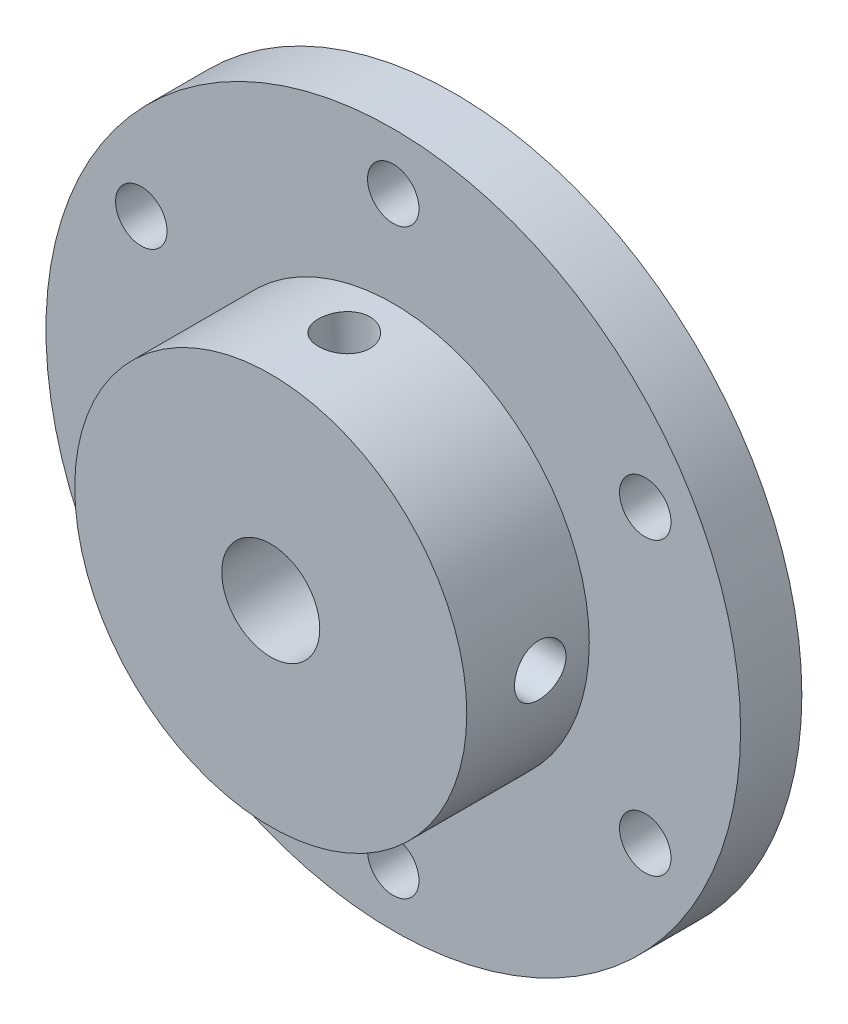
ISO-10303-21;
HEADER;
FILE_DESCRIPTION(('STEP AP214'),'2;1');
FILE_NAME('part.step','',(''),(''),'','','');
FILE_SCHEMA(('AUTOMOTIVE_DESIGN { 1 0 10303 214 1 1 1 1 }'));
ENDSEC;
DATA;
#1=APPLICATION_CONTEXT('core data for automotive mechanical design processes');
#2=APPLICATION_PROTOCOL_DEFINITION('international standard','automotive_design',2000,#1);
#3=PRODUCT_CONTEXT('',#1,'mechanical');
#4=PRODUCT('Part','Part','',(#3));
#5=PRODUCT_RELATED_PRODUCT_CATEGORY('part','',(#4));
#6=PRODUCT_DEFINITION_FORMATION('','',#4);
#7=PRODUCT_DEFINITION_CONTEXT('part definition',#1,'design');
#8=PRODUCT_DEFINITION('design','',#6,#7);
#9=PRODUCT_DEFINITION_SHAPE('','',#8);
#10=(LENGTH_UNIT() NAMED_UNIT(*) SI_UNIT(.MILLI.,.METRE.));
#11=(NAMED_UNIT(*) PLANE_ANGLE_UNIT() SI_UNIT($,.RADIAN.));
#12=(NAMED_UNIT(*) SI_UNIT($,.STERADIAN.) SOLID_ANGLE_UNIT());
#13=UNCERTAINTY_MEASURE_WITH_UNIT(LENGTH_MEASURE(1.E-05),#10,'distance_accuracy_value','');
#14=(GEOMETRIC_REPRESENTATION_CONTEXT(3) GLOBAL_UNCERTAINTY_ASSIGNED_CONTEXT((#13)) GLOBAL_UNIT_ASSIGNED_CONTEXT((#10,
#11,#12)) REPRESENTATION_CONTEXT('',''));
#15=CARTESIAN_POINT('',(0.,0.,0.));
#16=DIRECTION('',(0.,0.,1.));
#17=DIRECTION('',(1.,0.,0.));
#18=AXIS2_PLACEMENT_3D('',#15,#16,#17);
#19=CARTESIAN_POINT('',(0.,0.,5.));
#20=DIRECTION('',(0.,0.,-1.));
#21=DIRECTION('',(-1.,0.,0.));
#22=AXIS2_PLACEMENT_3D('',#19,#20,#21);
#23=CYLINDRICAL_SURFACE('',#22,28.35);
#24=CARTESIAN_POINT('',(0.,0.,5.));
#25=DIRECTION('',(0.,0.,1.));
#26=DIRECTION('',(1.,0.,0.));
#27=AXIS2_PLACEMENT_3D('',#24,#25,#26);
#28=CIRCLE('',#27,28.35);
#29=CARTESIAN_POINT('',(28.35,0.,5.));
#30=VERTEX_POINT('',#29);
#31=EDGE_CURVE('E10',#30,#30,#28,.T.);
#32=ORIENTED_EDGE('',*,*,#31,.F.);
#33=EDGE_LOOP('',(#32));
#34=FACE_BOUND('',#33,.T.);
#35=CARTESIAN_POINT('',(0.,0.,0.));
#36=DIRECTION('',(0.,0.,1.));
#37=DIRECTION('',(1.,0.,0.));
#38=AXIS2_PLACEMENT_3D('',#35,#36,#37);
#39=CIRCLE('',#38,28.35);
#40=CARTESIAN_POINT('',(28.35,0.,0.));
#41=VERTEX_POINT('',#40);
#42=EDGE_CURVE('E49',#41,#41,#39,.T.);
#43=ORIENTED_EDGE('',*,*,#42,.T.);
#44=EDGE_LOOP('',(#43));
#45=FACE_BOUND('',#44,.T.);
#46=ADVANCED_FACE('F46',(#34,#45),#23,.T.);
#47=CARTESIAN_POINT('',(0.,0.,5.));
#48=DIRECTION('',(0.,0.,1.));
#49=DIRECTION('',(1.,0.,0.));
#50=AXIS2_PLACEMENT_3D('',#47,#48,#49);
#51=PLANE('',#50);
#52=CARTESIAN_POINT('',(-20.5681033398803,11.8750000000002,5.));
#53=DIRECTION('',(0.,0.,1.));
#54=DIRECTION('',(1.,0.,0.));
#55=AXIS2_PLACEMENT_3D('',#52,#53,#54);
#56=CIRCLE('',#55,2.09999999999999);
#57=CARTESIAN_POINT('',(-18.4681033398803,11.8750000000002,5.));
#58=VERTEX_POINT('',#57);
#59=EDGE_CURVE('E119',#58,#58,#56,.T.);
#60=ORIENTED_EDGE('',*,*,#59,.F.);
#61=EDGE_LOOP('',(#60));
#62=FACE_BOUND('',#61,.T.);
#63=CARTESIAN_POINT('',(-20.5681033398805,-11.8749999999998,5.));
#64=DIRECTION('',(0.,0.,1.));
#65=DIRECTION('',(1.,0.,0.));
#66=AXIS2_PLACEMENT_3D('',#63,#64,#65);
#67=CIRCLE('',#66,2.09999999999999);
#68=CARTESIAN_POINT('',(-18.4681033398805,-11.8749999999998,5.));
#69=VERTEX_POINT('',#68);
#70=EDGE_CURVE('E112',#69,#69,#67,.T.);
#71=ORIENTED_EDGE('',*,*,#70,.F.);
#72=EDGE_LOOP('',(#71));
#73=FACE_BOUND('',#72,.T.);
#74=CARTESIAN_POINT('',(0.,-23.75,5.));
#75=DIRECTION('',(0.,0.,1.));
#76=DIRECTION('',(1.,0.,0.));
#77=AXIS2_PLACEMENT_3D('',#74,#75,#76);
#78=CIRCLE('',#77,2.09999999999999);
#79=CARTESIAN_POINT('',(2.09999999999999,-23.75,5.));
#80=VERTEX_POINT('',#79);
#81=EDGE_CURVE('E104',#80,#80,#78,.T.);
#82=ORIENTED_EDGE('',*,*,#81,.F.);
#83=EDGE_LOOP('',(#82));
#84=FACE_BOUND('',#83,.T.);
#85=CARTESIAN_POINT('',(20.5681033398804,-11.8750000000001,5.));
#86=DIRECTION('',(0.,0.,1.));
#87=DIRECTION('',(1.,0.,0.));
#88=AXIS2_PLACEMENT_3D('',#85,#86,#87);
#89=CIRCLE('',#88,2.09999999999999);
#90=CARTESIAN_POINT('',(22.6681033398804,-11.8750000000001,5.));
#91=VERTEX_POINT('',#90);
#92=EDGE_CURVE('E96',#91,#91,#89,.T.);
#93=ORIENTED_EDGE('',*,*,#92,.F.);
#94=EDGE_LOOP('',(#93));
#95=FACE_BOUND('',#94,.T.);
#96=CARTESIAN_POINT('',(20.5681033398804,11.875,5.));
#97=DIRECTION('',(0.,0.,1.));
#98=DIRECTION('',(1.,0.,0.));
#99=AXIS2_PLACEMENT_3D('',#96,#97,#98);
#100=CIRCLE('',#99,2.09999999999999);
#101=CARTESIAN_POINT('',(22.6681033398804,11.875,5.));
#102=VERTEX_POINT('',#101);
#103=EDGE_CURVE('E88',#102,#102,#100,.T.);
#104=ORIENTED_EDGE('',*,*,#103,.F.);
#105=EDGE_LOOP('',(#104));
#106=FACE_BOUND('',#105,.T.);
#107=CARTESIAN_POINT('',(0.,23.75,5.));
#108=DIRECTION('',(0.,0.,1.));
#109=DIRECTION('',(1.,0.,0.));
#110=AXIS2_PLACEMENT_3D('',#107,#108,#109);
#111=CIRCLE('',#110,2.09999999999999);
#112=CARTESIAN_POINT('',(2.09999999999999,23.75,5.));
#113=VERTEX_POINT('',#112);
#114=EDGE_CURVE('E80',#113,#113,#111,.T.);
#115=ORIENTED_EDGE('',*,*,#114,.F.);
#116=EDGE_LOOP('',(#115));
#117=FACE_BOUND('',#116,.T.);
#118=CARTESIAN_POINT('',(0.,0.,5.));
#119=DIRECTION('',(0.,0.,1.));
#120=DIRECTION('',(1.,0.,0.));
#121=AXIS2_PLACEMENT_3D('',#118,#119,#120);
#122=CIRCLE('',#121,16.);
#123=CARTESIAN_POINT('',(16.,0.,5.));
#124=VERTEX_POINT('',#123);
#125=EDGE_CURVE('E62',#124,#124,#122,.T.);
#126=ORIENTED_EDGE('',*,*,#125,.F.);
#127=EDGE_LOOP('',(#126));
#128=FACE_BOUND('',#127,.T.);
#129=ORIENTED_EDGE('',*,*,#31,.T.);
#130=EDGE_LOOP('',(#129));
#131=FACE_BOUND('',#130,.T.);
#132=ADVANCED_FACE('F182',(#62,#73,#84,#95,#106,#117,#128,#131),#51,.T.);
#133=CARTESIAN_POINT('',(0.,0.,0.));
#134=DIRECTION('',(0.,0.,1.));
#135=DIRECTION('',(1.,0.,0.));
#136=AXIS2_PLACEMENT_3D('',#133,#134,#135);
#137=PLANE('',#136);
#138=CARTESIAN_POINT('',(-20.5681033398803,11.8750000000002,0.));
#139=DIRECTION('',(0.,0.,1.));
#140=DIRECTION('',(1.,0.,0.));
#141=AXIS2_PLACEMENT_3D('',#138,#139,#140);
#142=CIRCLE('',#141,2.1);
#143=CARTESIAN_POINT('',(-18.4681033398803,11.8750000000002,0.));
#144=VERTEX_POINT('',#143);
#145=EDGE_CURVE('E115',#144,#144,#142,.T.);
#146=ORIENTED_EDGE('',*,*,#145,.T.);
#147=EDGE_LOOP('',(#146));
#148=FACE_BOUND('',#147,.T.);
#149=CARTESIAN_POINT('',(-20.5681033398805,-11.8749999999998,0.));
#150=DIRECTION('',(0.,0.,1.));
#151=DIRECTION('',(1.,0.,0.));
#152=AXIS2_PLACEMENT_3D('',#149,#150,#151);
#153=CIRCLE('',#152,2.1);
#154=CARTESIAN_POINT('',(-18.4681033398805,-11.8749999999998,0.));
#155=VERTEX_POINT('',#154);
#156=EDGE_CURVE('E108',#155,#155,#153,.T.);
#157=ORIENTED_EDGE('',*,*,#156,.T.);
#158=EDGE_LOOP('',(#157));
#159=FACE_BOUND('',#158,.T.);
#160=CARTESIAN_POINT('',(0.,-23.75,0.));
#161=DIRECTION('',(0.,0.,1.));
#162=DIRECTION('',(1.,0.,0.));
#163=AXIS2_PLACEMENT_3D('',#160,#161,#162);
#164=CIRCLE('',#163,2.1);
#165=CARTESIAN_POINT('',(2.1,-23.75,0.));
#166=VERTEX_POINT('',#165);
#167=EDGE_CURVE('E100',#166,#166,#164,.T.);
#168=ORIENTED_EDGE('',*,*,#167,.T.);
#169=EDGE_LOOP('',(#168));
#170=FACE_BOUND('',#169,.T.);
#171=CARTESIAN_POINT('',(20.5681033398804,-11.8750000000001,0.));
#172=DIRECTION('',(0.,0.,1.));
#173=DIRECTION('',(1.,0.,0.));
#174=AXIS2_PLACEMENT_3D('',#171,#172,#173);
#175=CIRCLE('',#174,2.1);
#176=CARTESIAN_POINT('',(22.6681033398804,-11.8750000000001,0.));
#177=VERTEX_POINT('',#176);
#178=EDGE_CURVE('E92',#177,#177,#175,.T.);
#179=ORIENTED_EDGE('',*,*,#178,.T.);
#180=EDGE_LOOP('',(#179));
#181=FACE_BOUND('',#180,.T.);
#182=CARTESIAN_POINT('',(20.5681033398804,11.875,0.));
#183=DIRECTION('',(0.,0.,1.));
#184=DIRECTION('',(1.,0.,0.));
#185=AXIS2_PLACEMENT_3D('',#182,#183,#184);
#186=CIRCLE('',#185,2.1);
#187=CARTESIAN_POINT('',(22.6681033398804,11.875,0.));
#188=VERTEX_POINT('',#187);
#189=EDGE_CURVE('E84',#188,#188,#186,.T.);
#190=ORIENTED_EDGE('',*,*,#189,.T.);
#191=EDGE_LOOP('',(#190));
#192=FACE_BOUND('',#191,.T.);
#193=CARTESIAN_POINT('',(0.,23.75,0.));
#194=DIRECTION('',(0.,0.,1.));
#195=DIRECTION('',(1.,0.,0.));
#196=AXIS2_PLACEMENT_3D('',#193,#194,#195);
#197=CIRCLE('',#196,2.1);
#198=CARTESIAN_POINT('',(2.1,23.75,0.));
#199=VERTEX_POINT('',#198);
#200=EDGE_CURVE('E73',#199,#199,#197,.T.);
#201=ORIENTED_EDGE('',*,*,#200,.T.);
#202=EDGE_LOOP('',(#201));
#203=FACE_BOUND('',#202,.T.);
#204=CARTESIAN_POINT('',(0.,0.,0.));
#205=DIRECTION('',(0.,0.,1.));
#206=DIRECTION('',(1.,0.,0.));
#207=AXIS2_PLACEMENT_3D('',#204,#205,#206);
#208=CIRCLE('',#207,4.);
#209=CARTESIAN_POINT('',(4.,0.,0.));
#210=VERTEX_POINT('',#209);
#211=EDGE_CURVE('E66',#210,#210,#208,.T.);
#212=ORIENTED_EDGE('',*,*,#211,.T.);
#213=EDGE_LOOP('',(#212));
#214=FACE_BOUND('',#213,.T.);
#215=ORIENTED_EDGE('',*,*,#42,.F.);
#216=EDGE_LOOP('',(#215));
#217=FACE_BOUND('',#216,.T.);
#218=ADVANCED_FACE('F186',(#148,#159,#170,#181,#192,#203,#214,#217),#137,.F.);
#219=CARTESIAN_POINT('',(0.,0.,15.));
#220=DIRECTION('',(0.,0.,-1.));
#221=DIRECTION('',(-1.,0.,0.));
#222=AXIS2_PLACEMENT_3D('',#219,#220,#221);
#223=CYLINDRICAL_SURFACE('',#222,16.);
#224=CARTESIAN_POINT('',(0.,16.,6.9));
#225=CARTESIAN_POINT('',(0.117416484353101,15.9999982962631,6.90000495705236));
#226=CARTESIAN_POINT('',(0.234905122011886,15.9986938773925,6.90988080691643));
#227=CARTESIAN_POINT('',(0.46660966558349,15.9936157778764,6.94911967052718));
#228=CARTESIAN_POINT('',(0.580822081998047,15.9898395595276,6.97850271201433));
#229=CARTESIAN_POINT('',(0.802586512568985,15.9802430281394,7.05587240992261));
#230=CARTESIAN_POINT('',(0.910143079615392,15.9744241309754,7.10384618263218));
#231=CARTESIAN_POINT('',(1.1156593399402,15.9613884397463,7.21700655797674));
#232=CARTESIAN_POINT('',(1.21362060219516,15.9541718747973,7.28219034005323));
#233=CARTESIAN_POINT('',(1.39777717587374,15.9390970395828,7.4283413083698));
#234=CARTESIAN_POINT('',(1.48390610575507,15.9312355150333,7.50939181113075));
#235=CARTESIAN_POINT('',(1.64138117851605,15.9157828604001,7.68479647193949));
#236=CARTESIAN_POINT('',(1.71272654645484,15.908191744508,7.77915132695387));
#237=CARTESIAN_POINT('',(1.83885928171324,15.8941075163014,7.9789213126258));
#238=CARTESIAN_POINT('',(1.89358395666576,15.8876186009931,8.08437634803382));
#239=CARTESIAN_POINT('',(1.98452144739534,15.8765168113299,8.30307955175785));
#240=CARTESIAN_POINT('',(2.02073503589053,15.8719038586674,8.41632739455061));
#241=CARTESIAN_POINT('',(2.0734195616491,15.8651076274545,8.64671017399985));
#242=CARTESIAN_POINT('',(2.0900029894288,15.8629105101852,8.76381897060127));
#243=CARTESIAN_POINT('',(2.10330463008907,15.8611524584727,8.9991763708029));
#244=CARTESIAN_POINT('',(2.10002372107694,15.8615914075016,9.11742492378924));
#245=CARTESIAN_POINT('',(2.07378206445453,15.8650432287045,9.35091875534377));
#246=CARTESIAN_POINT('',(2.05094554741099,15.86803985239,9.46617827025772));
#247=CARTESIAN_POINT('',(1.98643489899057,15.8762440291591,9.69121497797564));
#248=CARTESIAN_POINT('',(1.94476035031288,15.8814516312202,9.80099204927247));
#249=CARTESIAN_POINT('',(1.84362411100889,15.8935093147413,10.0123317781193));
#250=CARTESIAN_POINT('',(1.78410875473803,15.9003643391794,10.1138684605443));
#251=CARTESIAN_POINT('',(1.64901867206016,15.9149407211294,10.3055604124572));
#252=CARTESIAN_POINT('',(1.57344313629226,15.9226621222936,10.395715107979));
#253=CARTESIAN_POINT('',(1.40769104741128,15.9381733835384,10.5628047526722));
#254=CARTESIAN_POINT('',(1.31740747591083,15.9459633163989,10.6396335731953));
#255=CARTESIAN_POINT('',(1.12516973659486,15.9606788849759,10.7770631591691));
#256=CARTESIAN_POINT('',(1.02321553695396,15.9676045183355,10.8376638803649));
#257=CARTESIAN_POINT('',(0.810446436820828,15.9798160936183,10.9409183626588));
#258=CARTESIAN_POINT('',(0.699628098002014,15.9851013953531,10.9835651189946));
#259=CARTESIAN_POINT('',(0.472318289200564,15.9934311173904,11.0496149743927));
#260=CARTESIAN_POINT('',(0.355827112547463,15.9964756534268,11.0730190673325));
#261=CARTESIAN_POINT('',(0.121395629387381,15.9999656992249,11.0997808566156));
#262=CARTESIAN_POINT('',(0.00347227541262585,16.0004301540478,11.103284681241));
#263=CARTESIAN_POINT('',(-0.231280014343775,15.9987589549612,11.0905326292899));
#264=CARTESIAN_POINT('',(-0.348108975814987,15.9966233622396,11.0742772177153));
#265=CARTESIAN_POINT('',(-0.576922284105939,15.990003800972,11.0225895536893));
#266=CARTESIAN_POINT('',(-0.688922719796446,15.9855284102365,10.9872273319612));
#267=CARTESIAN_POINT('',(-0.905403997412974,15.974730073111,10.8984029024912));
#268=CARTESIAN_POINT('',(-1.00988456025589,15.9684070581947,10.8449400234038));
#269=CARTESIAN_POINT('',(-1.2090105555854,15.9545706371482,10.721080854769));
#270=CARTESIAN_POINT('',(-1.30359699513709,15.947050698098,10.6505904659569));
#271=CARTESIAN_POINT('',(-1.47964872574463,15.9316811346644,10.4948098674338));
#272=CARTESIAN_POINT('',(-1.56111344006267,15.9238314958089,10.4095190075414));
#273=CARTESIAN_POINT('',(-1.70913080865221,15.9086283992346,10.2259132317372));
#274=CARTESIAN_POINT('',(-1.77558633636806,15.9012783770394,10.1275196890213));
#275=CARTESIAN_POINT('',(-1.89102695628024,15.8879642527691,9.9208813855286));
#276=CARTESIAN_POINT('',(-1.94001242853152,15.8820001205453,9.81263683912125));
#277=CARTESIAN_POINT('',(-2.01896672841902,15.8721568354206,9.58967701758747));
#278=CARTESIAN_POINT('',(-2.04898946191644,15.8682717771357,9.47498110347114));
#279=CARTESIAN_POINT('',(-2.08933920892608,15.8630098837321,9.24212126875103));
#280=CARTESIAN_POINT('',(-2.09966724065018,15.8616329189455,9.12395752775389));
#281=CARTESIAN_POINT('',(-2.10031443069061,15.8615471546198,8.88848292944531));
#282=CARTESIAN_POINT('',(-2.09078619999575,15.8628180045269,8.77117246991539));
#283=CARTESIAN_POINT('',(-2.05231540968838,15.8678408142836,8.53983620079543));
#284=CARTESIAN_POINT('',(-2.02337285486407,15.8715927735212,8.4258103903953));
#285=CARTESIAN_POINT('',(-1.94694420408523,15.8811485642185,8.20430550752034));
#286=CARTESIAN_POINT('',(-1.89946624400469,15.8869514953252,8.09682358658503));
#287=CARTESIAN_POINT('',(-1.78732950445978,15.8999567709492,7.89132723687448));
#288=CARTESIAN_POINT('',(-1.7226704229297,15.9071591400699,7.79331297459389));
#289=CARTESIAN_POINT('',(-1.57744326503153,15.9222180092564,7.60875508025564));
#290=CARTESIAN_POINT('',(-1.49676157774286,15.9300789344295,7.52230120152492));
#291=CARTESIAN_POINT('',(-1.32201773458277,15.9455305998353,7.36410229468749));
#292=CARTESIAN_POINT('',(-1.22795244033518,15.9531212761728,7.29236072619036));
#293=CARTESIAN_POINT('',(-1.02865642383035,15.9672126278133,7.16536363306548));
#294=CARTESIAN_POINT('',(-0.92338060789378,15.9737086069784,7.1101783818222));
#295=CARTESIAN_POINT('',(-0.705026961411324,15.9848315489309,7.01835047192648));
#296=CARTESIAN_POINT('',(-0.591957665878867,15.9894605194548,6.98168788366503));
#297=CARTESIAN_POINT('',(-0.398600577498265,15.9952257223333,6.93661582244385));
#298=CARTESIAN_POINT('',(-0.319526543474694,15.9970072452264,6.92290490974843));
#299=CARTESIAN_POINT('',(-0.160312880332424,15.9993949607654,6.90459534461191));
#300=CARTESIAN_POINT('',(-0.0801732602122652,16.0000011633302,6.89999661527041));
#301=CARTESIAN_POINT('',(0.,16.,6.9));
#302=B_SPLINE_CURVE_WITH_KNOTS('',3,(#224,#225,#226,#227,#228,#229,#230,#231,#232,#233,#234,
#235,#236,#237,#238,#239,#240,#241,#242,#243,#244,#245,#246,#247,#248,#249,#250,#251,#252,#253,
#254,#255,#256,#257,#258,#259,#260,#261,#262,#263,#264,#265,#266,#267,#268,#269,#270,#271,#272,
#273,#274,#275,#276,#277,#278,#279,#280,#281,#282,#283,#284,#285,#286,#287,#288,#289,#290,#291,
#292,#293,#294,#295,#296,#297,#298,#299,#300,#301),.UNSPECIFIED.,.T.,.F.,(4,2,2,2,2,2,2,2,2,2,2,
2,2,2,2,2,2,2,2,2,2,2,2,2,2,2,2,2,2,2,2,2,2,2,2,2,2,2,4),(0.,0.351956579597511,
0.704275067694986,1.05634982812868,1.40836692260357,1.76228460352201,2.11622083179281,
2.47147596652803,2.82671627044792,3.17991086217002,3.53308984096311,3.88404169036012,
4.23500131443719,4.58702741286474,4.93907125603529,5.29380151830566,5.64853274793558,
6.00340224843456,6.3582534188827,6.71049550361345,7.06272929905445,7.41368075090289,
7.76464522081313,8.11759548065945,8.47056124946068,8.82574953425381,9.18093009157841,
9.53509636913479,9.88924433587378,10.2406804386662,10.5921164547833,10.9433983857755,
11.2946864931543,11.6485606276522,12.0025178807117,12.3579569170413,12.7130126970204,
12.9533345286082,13.1936543320409),.UNSPECIFIED.);
#303=CARTESIAN_POINT('',(0.,16.,6.9));
#304=VERTEX_POINT('',#303);
#305=EDGE_CURVE('E324',#304,#304,#302,.T.);
#306=ORIENTED_EDGE('',*,*,#305,.T.);
#307=EDGE_LOOP('',(#306));
#308=FACE_BOUND('',#307,.T.);
#309=CARTESIAN_POINT('',(16.,0.,11.1));
#310=CARTESIAN_POINT('',(15.9999982962631,0.117416484353101,11.0999950429476));
#311=CARTESIAN_POINT('',(15.9986938773925,0.234905122011886,11.0901191930836));
#312=CARTESIAN_POINT('',(15.9936157778764,0.46660966558349,11.0508803294728));
#313=CARTESIAN_POINT('',(15.9898395595276,0.580822081998047,11.0214972879857));
#314=CARTESIAN_POINT('',(15.9802430281394,0.802586512568985,10.9441275900774));
#315=CARTESIAN_POINT('',(15.9744241309754,0.910143079615392,10.8961538173678));
#316=CARTESIAN_POINT('',(15.9613884397463,1.1156593399402,10.7829934420233));
#317=CARTESIAN_POINT('',(15.9541718747973,1.21362060219516,10.7178096599468));
#318=CARTESIAN_POINT('',(15.9390970395828,1.39777717587374,10.5716586916302));
#319=CARTESIAN_POINT('',(15.9312355150333,1.48390610575507,10.4906081888693));
#320=CARTESIAN_POINT('',(15.9157828604001,1.64138117851605,10.3152035280605));
#321=CARTESIAN_POINT('',(15.908191744508,1.71272654645484,10.2208486730461));
#322=CARTESIAN_POINT('',(15.8941075163014,1.83885928171324,10.0210786873742));
#323=CARTESIAN_POINT('',(15.8876186009931,1.89358395666576,9.91562365196618));
#324=CARTESIAN_POINT('',(15.8765168113299,1.98452144739534,9.69692044824215));
#325=CARTESIAN_POINT('',(15.8719038586674,2.02073503589053,9.58367260544939));
#326=CARTESIAN_POINT('',(15.8651076274545,2.0734195616491,9.35328982600015));
#327=CARTESIAN_POINT('',(15.8629105101852,2.0900029894288,9.23618102939873));
#328=CARTESIAN_POINT('',(15.8611524584727,2.10330463008907,9.0008236291971));
#329=CARTESIAN_POINT('',(15.8615914075016,2.10002372107694,8.88257507621077));
#330=CARTESIAN_POINT('',(15.8650432287045,2.07378206445453,8.64908124465623));
#331=CARTESIAN_POINT('',(15.86803985239,2.05094554741099,8.53382172974228));
#332=CARTESIAN_POINT('',(15.8762440291591,1.98643489899057,8.30878502202437));
#333=CARTESIAN_POINT('',(15.8814516312202,1.94476035031288,8.19900795072753));
#334=CARTESIAN_POINT('',(15.8935093147413,1.84362411100889,7.98766822188072));
#335=CARTESIAN_POINT('',(15.9003643391794,1.78410875473803,7.88613153945571));
#336=CARTESIAN_POINT('',(15.9149407211294,1.64901867206016,7.69443958754275));
#337=CARTESIAN_POINT('',(15.9226621222936,1.57344313629226,7.60428489202098));
#338=CARTESIAN_POINT('',(15.9381733835384,1.40769104741128,7.43719524732779));
#339=CARTESIAN_POINT('',(15.9459633163989,1.31740747591083,7.36036642680472));
#340=CARTESIAN_POINT('',(15.9606788849759,1.12516973659486,7.22293684083089));
#341=CARTESIAN_POINT('',(15.9676045183355,1.02321553695397,7.16233611963506));
#342=CARTESIAN_POINT('',(15.9798160936183,0.81044643682083,7.05908163734115));
#343=CARTESIAN_POINT('',(15.9851013953531,0.699628098002016,7.01643488100538));
#344=CARTESIAN_POINT('',(15.9934311173904,0.472318289200565,6.95038502560732));
#345=CARTESIAN_POINT('',(15.9964756534268,0.355827112547464,6.92698093266746));
#346=CARTESIAN_POINT('',(15.9999656992249,0.121395629387381,6.90021914338435));
#347=CARTESIAN_POINT('',(16.0004301540478,0.00347227541262604,6.89671531875902));
#348=CARTESIAN_POINT('',(15.9987589549612,-0.231280014343775,6.90946737071011));
#349=CARTESIAN_POINT('',(15.9966233622396,-0.348108975814986,6.92572278228472));
#350=CARTESIAN_POINT('',(15.990003800972,-0.576922284105938,6.97741044631073));
#351=CARTESIAN_POINT('',(15.9855284102365,-0.688922719796446,7.01277266803877));
#352=CARTESIAN_POINT('',(15.974730073111,-0.905403997412974,7.10159709750879));
#353=CARTESIAN_POINT('',(15.9684070581947,-1.00988456025589,7.15505997659622));
#354=CARTESIAN_POINT('',(15.9545706371482,-1.2090105555854,7.27891914523096));
#355=CARTESIAN_POINT('',(15.947050698098,-1.30359699513709,7.34940953404312));
#356=CARTESIAN_POINT('',(15.9316811346644,-1.47964872574463,7.50519013256623));
#357=CARTESIAN_POINT('',(15.9238314958089,-1.56111344006267,7.59048099245864));
#358=CARTESIAN_POINT('',(15.9086283992346,-1.70913080865221,7.77408676826283));
#359=CARTESIAN_POINT('',(15.9012783770394,-1.77558633636806,7.87248031097871));
#360=CARTESIAN_POINT('',(15.8879642527691,-1.89102695628024,8.0791186144714));
#361=CARTESIAN_POINT('',(15.8820001205454,-1.94001242853152,8.18736316087875));
#362=CARTESIAN_POINT('',(15.8721568354206,-2.01896672841902,8.41032298241254));
#363=CARTESIAN_POINT('',(15.8682717771357,-2.04898946191644,8.52501889652886));
#364=CARTESIAN_POINT('',(15.8630098837321,-2.08933920892608,8.75787873124897));
#365=CARTESIAN_POINT('',(15.8616329189455,-2.09966724065018,8.87604247224611));
#366=CARTESIAN_POINT('',(15.8615471546198,-2.10031443069061,9.11151707055469));
#367=CARTESIAN_POINT('',(15.8628180045269,-2.09078619999575,9.22882753008461));
#368=CARTESIAN_POINT('',(15.8678408142836,-2.05231540968838,9.46016379920457));
#369=CARTESIAN_POINT('',(15.8715927735212,-2.02337285486407,9.5741896096047));
#370=CARTESIAN_POINT('',(15.8811485642185,-1.94694420408523,9.79569449247966));
#371=CARTESIAN_POINT('',(15.8869514953252,-1.89946624400469,9.90317641341496));
#372=CARTESIAN_POINT('',(15.8999567709492,-1.78732950445978,10.1086727631255));
#373=CARTESIAN_POINT('',(15.9071591400699,-1.7226704229297,10.2066870254061));
#374=CARTESIAN_POINT('',(15.9222180092564,-1.57744326503153,10.3912449197444));
#375=CARTESIAN_POINT('',(15.9300789344295,-1.49676157774286,10.4776987984751));
#376=CARTESIAN_POINT('',(15.9455305998353,-1.32201773458277,10.6358977053125));
#377=CARTESIAN_POINT('',(15.9531212761728,-1.22795244033518,10.7076392738096));
#378=CARTESIAN_POINT('',(15.9672126278133,-1.02865642383035,10.8346363669345));
#379=CARTESIAN_POINT('',(15.9737086069784,-0.923380607893781,10.8898216181778));
#380=CARTESIAN_POINT('',(15.9848315489309,-0.705026961411324,10.9816495280735));
#381=CARTESIAN_POINT('',(15.9894605194548,-0.591957665878868,11.018312116335));
#382=CARTESIAN_POINT('',(15.9952257223333,-0.398600577498267,11.0633841775562));
#383=CARTESIAN_POINT('',(15.9970072452264,-0.319526543474696,11.0770950902516));
#384=CARTESIAN_POINT('',(15.9993949607654,-0.160312880332425,11.0954046553881));
#385=CARTESIAN_POINT('',(16.0000011633302,-0.0801732602122659,11.1000033847296));
#386=CARTESIAN_POINT('',(16.,0.,11.1));
#387=B_SPLINE_CURVE_WITH_KNOTS('',3,(#309,#310,#311,#312,#313,#314,#315,#316,#317,#318,#319,
#320,#321,#322,#323,#324,#325,#326,#327,#328,#329,#330,#331,#332,#333,#334,#335,#336,#337,#338,
#339,#340,#341,#342,#343,#344,#345,#346,#347,#348,#349,#350,#351,#352,#353,#354,#355,#356,#357,
#358,#359,#360,#361,#362,#363,#364,#365,#366,#367,#368,#369,#370,#371,#372,#373,#374,#375,#376,
#377,#378,#379,#380,#381,#382,#383,#384,#385,#386),.UNSPECIFIED.,.T.,.F.,(4,2,2,2,2,2,2,2,2,2,2,
2,2,2,2,2,2,2,2,2,2,2,2,2,2,2,2,2,2,2,2,2,2,2,2,2,2,2,4),(0.,0.351956579597511,
0.704275067694986,1.05634982812868,1.40836692260357,1.76228460352201,2.11622083179281,
2.47147596652803,2.82671627044793,3.17991086217002,3.53308984096311,3.88404169036011,
4.23500131443719,4.58702741286474,4.93907125603529,5.29380151830566,5.64853274793558,
6.00340224843456,6.3582534188827,6.71049550361345,7.06272929905445,7.41368075090289,
7.76464522081313,8.11759548065946,8.47056124946068,8.82574953425381,9.18093009157841,
9.53509636913479,9.88924433587378,10.2406804386662,10.5921164547833,10.9433983857755,
11.2946864931543,11.6485606276522,12.0025178807117,12.3579569170413,12.7130126970204,
12.9533345286082,13.1936543320409),.UNSPECIFIED.);
#388=CARTESIAN_POINT('',(16.,0.,11.1));
#389=VERTEX_POINT('',#388);
#390=EDGE_CURVE('E132',#389,#389,#387,.T.);
#391=ORIENTED_EDGE('',*,*,#390,.T.);
#392=EDGE_LOOP('',(#391));
#393=FACE_BOUND('',#392,.T.);
#394=CARTESIAN_POINT('',(0.,0.,15.));
#395=DIRECTION('',(0.,0.,1.));
#396=DIRECTION('',(1.,0.,0.));
#397=AXIS2_PLACEMENT_3D('',#394,#395,#396);
#398=CIRCLE('',#397,16.);
#399=CARTESIAN_POINT('',(16.,0.,15.));
#400=VERTEX_POINT('',#399);
#401=EDGE_CURVE('E60',#400,#400,#398,.T.);
#402=ORIENTED_EDGE('',*,*,#401,.F.);
#403=EDGE_LOOP('',(#402));
#404=FACE_BOUND('',#403,.T.);
#405=ORIENTED_EDGE('',*,*,#125,.T.);
#406=EDGE_LOOP('',(#405));
#407=FACE_BOUND('',#406,.T.);
#408=ADVANCED_FACE('F193',(#308,#393,#404,#407),#223,.T.);
#409=CARTESIAN_POINT('',(0.,0.,15.));
#410=DIRECTION('',(0.,0.,1.));
#411=DIRECTION('',(1.,0.,0.));
#412=AXIS2_PLACEMENT_3D('',#409,#410,#411);
#413=PLANE('',#412);
#414=CARTESIAN_POINT('',(0.,0.,15.));
#415=DIRECTION('',(0.,0.,1.));
#416=DIRECTION('',(1.,0.,0.));
#417=AXIS2_PLACEMENT_3D('',#414,#415,#416);
#418=CIRCLE('',#417,4.);
#419=CARTESIAN_POINT('',(4.,0.,15.));
#420=VERTEX_POINT('',#419);
#421=EDGE_CURVE('E70',#420,#420,#418,.T.);
#422=ORIENTED_EDGE('',*,*,#421,.F.);
#423=EDGE_LOOP('',(#422));
#424=FACE_BOUND('',#423,.T.);
#425=ORIENTED_EDGE('',*,*,#401,.T.);
#426=EDGE_LOOP('',(#425));
#427=FACE_BOUND('',#426,.T.);
#428=ADVANCED_FACE('F177',(#424,#427),#413,.T.);
#429=CARTESIAN_POINT('',(0.,0.,0.));
#430=DIRECTION('',(0.,0.,1.));
#431=DIRECTION('',(1.,0.,0.));
#432=AXIS2_PLACEMENT_3D('',#429,#430,#431);
#433=CYLINDRICAL_SURFACE('',#432,4.);
#434=CARTESIAN_POINT('',(0.,4.,6.9));
#435=CARTESIAN_POINT('',(-0.109725239522176,3.99999264287857,6.90000850817598));
#436=CARTESIAN_POINT('',(-0.219566121797986,3.99543735627817,6.90865077782147));
#437=CARTESIAN_POINT('',(-0.435956332853303,3.97766056559727,6.94282051483628));
#438=CARTESIAN_POINT('',(-0.54249996702617,3.96442485872988,6.96837565544408));
#439=CARTESIAN_POINT('',(-0.748847767256637,3.93066356262107,7.03507317958002));
#440=CARTESIAN_POINT('',(-0.84867708849202,3.91016722161181,7.07615306803517));
#441=CARTESIAN_POINT('',(-1.0398542926017,3.86372814833453,7.17238731973));
#442=CARTESIAN_POINT('',(-1.13120230734359,3.83778550076629,7.22754146409275));
#443=CARTESIAN_POINT('',(-1.30947182891695,3.78081963010103,7.35439519620999));
#444=CARTESIAN_POINT('',(-1.39572427915895,3.7495762633363,7.42693455056421));
#445=CARTESIAN_POINT('',(-1.55546505007128,3.68618069665244,7.58467431609372));
#446=CARTESIAN_POINT('',(-1.62894256542358,3.65402775386038,7.66988533331476));
#447=CARTESIAN_POINT('',(-1.76753210720386,3.58917602274785,7.85947583581847));
#448=CARTESIAN_POINT('',(-1.83134596949796,3.55667651133239,7.96488088862584));
#449=CARTESIAN_POINT('',(-1.940078009522,3.49855992208216,8.18677898740505));
#450=CARTESIAN_POINT('',(-1.98501055983617,3.47293761465966,8.30326351646583));
#451=CARTESIAN_POINT('',(-2.05162778973323,3.43398312295476,8.5367308980096));
#452=CARTESIAN_POINT('',(-2.07458133375183,3.41998733122417,8.65323490430199));
#453=CARTESIAN_POINT('',(-2.1004206577409,3.40418721984817,8.88920803865535));
#454=CARTESIAN_POINT('',(-2.10333025607272,3.40236843025801,9.00867347806353));
#455=CARTESIAN_POINT('',(-2.08992575686748,3.41060563138389,9.22976414099399));
#456=CARTESIAN_POINT('',(-2.07615752002026,3.4190893964975,9.33161764684634));
#457=CARTESIAN_POINT('',(-2.03424482005422,3.44418916575293,9.53128014863959));
#458=CARTESIAN_POINT('',(-2.00609491145432,3.460808250155,9.62908759740539));
#459=CARTESIAN_POINT('',(-1.93576201725035,3.50064017337879,9.82066055866448));
#460=CARTESIAN_POINT('',(-1.89327386515966,3.52399463994301,9.91428317361142));
#461=CARTESIAN_POINT('',(-1.79571666755297,3.57469177714186,10.0935387455401));
#462=CARTESIAN_POINT('',(-1.74064200304353,3.60203622704668,10.179168109977));
#463=CARTESIAN_POINT('',(-1.61039398180522,3.66230444404028,10.3527804224098));
#464=CARTESIAN_POINT('',(-1.53347842501707,3.69546972830905,10.4393772694657));
#465=CARTESIAN_POINT('',(-1.36616462781175,3.76053926987168,10.5990549205067));
#466=CARTESIAN_POINT('',(-1.27575868558247,3.79244279356364,10.6721279498543));
#467=CARTESIAN_POINT('',(-1.07766804032998,3.85356353260701,10.8065821206847));
#468=CARTESIAN_POINT('',(-0.969298919443499,3.88252998474475,10.8670784688117));
#469=CARTESIAN_POINT('',(-0.742023442184863,3.93228772595726,10.968462670715));
#470=CARTESIAN_POINT('',(-0.623126340783868,3.95308610970455,11.0093675481865));
#471=CARTESIAN_POINT('',(-0.38939697462669,3.9825873442618,11.0667726791061));
#472=CARTESIAN_POINT('',(-0.275130823094224,3.99219507728301,11.0851069092832));
#473=CARTESIAN_POINT('',(-0.0447608666750934,4.00140669767392,11.1026931490091));
#474=CARTESIAN_POINT('',(0.0713418920739008,4.00101608864393,11.1019556566101));
#475=CARTESIAN_POINT('',(0.291279078552976,3.99076728683619,11.0823727421171));
#476=CARTESIAN_POINT('',(0.395299675486035,3.98173859499713,11.0651137704503));
#477=CARTESIAN_POINT('',(0.59872818219623,3.95626547527309,11.0155612495609));
#478=CARTESIAN_POINT('',(0.69813560404272,3.93982026491349,10.9832661139467));
#479=CARTESIAN_POINT('',(0.892553327327725,3.90044221082327,10.9038557461813));
#480=CARTESIAN_POINT('',(0.987382033379108,3.87735176388228,10.8563769257327));
#481=CARTESIAN_POINT('',(1.16801156602731,3.82682103032807,10.7483808249652));
#482=CARTESIAN_POINT('',(1.25380875133066,3.79937900035166,10.687858315483));
#483=CARTESIAN_POINT('',(1.42355402164766,3.73930849945052,10.5481654461086));
#484=CARTESIAN_POINT('',(1.50635375236175,3.70643824529688,10.4677018611849));
#485=CARTESIAN_POINT('',(1.65784945462858,3.64120206418591,10.2941486211428));
#486=CARTESIAN_POINT('',(1.72653319455466,3.60883659688132,10.201048131041));
#487=CARTESIAN_POINT('',(1.85197407713203,3.54618291275876,9.99766440984089));
#488=CARTESIAN_POINT('',(1.90772058421701,3.51615003477916,9.88667176437289));
#489=CARTESIAN_POINT('',(1.99916377433976,3.46498558301669,9.65483877403567));
#490=CARTESIAN_POINT('',(2.03488847416355,3.44384158132139,9.53401246223887));
#491=CARTESIAN_POINT('',(2.0817922879402,3.41567335738197,9.29850950473885));
#492=CARTESIAN_POINT('',(2.09503212797939,3.40746939702879,9.18438896876743));
#493=CARTESIAN_POINT('',(2.10264402498695,3.40278132518373,8.95530691556187));
#494=CARTESIAN_POINT('',(2.09702755352026,3.40629008804561,8.8403459520825));
#495=CARTESIAN_POINT('',(2.06905731966412,3.42333280060867,8.62683038567777));
#496=CARTESIAN_POINT('',(2.04869586578454,3.4356715106149,8.52790566448715));
#497=CARTESIAN_POINT('',(1.99445953447468,3.4674360798436,8.33503918598775));
#498=CARTESIAN_POINT('',(1.96057985676337,3.48686445637591,8.24109921218762));
#499=CARTESIAN_POINT('',(1.87782708009151,3.53215539501753,8.05400339874303));
#500=CARTESIAN_POINT('',(1.82811697206111,3.55835615136984,7.96130230842267));
#501=CARTESIAN_POINT('',(1.71597189148522,3.61377283019222,7.78493769078178));
#502=CARTESIAN_POINT('',(1.65353007488422,3.64299037017672,7.70127906149174));
#503=CARTESIAN_POINT('',(1.50756499361578,3.7059946066124,7.53327635286589));
#504=CARTESIAN_POINT('',(1.42231898680452,3.73985298438168,7.45044649023367));
#505=CARTESIAN_POINT('',(1.2383912708079,3.80472261290781,7.29984260805439));
#506=CARTESIAN_POINT('',(1.13970134446325,3.83573210281286,7.23207786376617));
#507=CARTESIAN_POINT('',(0.928722586410791,3.89224463430732,7.11256635095882));
#508=CARTESIAN_POINT('',(0.816206474636303,3.91762876470986,7.06115698939364));
#509=CARTESIAN_POINT('',(0.641101799511678,3.94873745727715,6.99929208684427));
#510=CARTESIAN_POINT('',(0.581718321049472,3.95794212176884,6.98121864301116));
#511=CARTESIAN_POINT('',(0.461272845180563,3.97377707651405,6.95034560887323));
#512=CARTESIAN_POINT('',(0.400211824286287,3.98040883184999,6.93754301695129));
#513=CARTESIAN_POINT('',(0.282777177199968,3.99038534961525,6.91835748923453));
#514=CARTESIAN_POINT('',(0.226504746010373,3.99398117175069,6.91148289088822));
#515=CARTESIAN_POINT('',(0.113498532604898,3.99879042332403,6.90230190074297));
#516=CARTESIAN_POINT('',(0.0567647413745307,4.00000380609873,6.8999955984201));
#517=CARTESIAN_POINT('',(0.,4.,6.9));
#518=B_SPLINE_CURVE_WITH_KNOTS('',3,(#434,#435,#436,#437,#438,#439,#440,#441,#442,#443,#444,
#445,#446,#447,#448,#449,#450,#451,#452,#453,#454,#455,#456,#457,#458,#459,#460,#461,#462,#463,
#464,#465,#466,#467,#468,#469,#470,#471,#472,#473,#474,#475,#476,#477,#478,#479,#480,#481,#482,
#483,#484,#485,#486,#487,#488,#489,#490,#491,#492,#493,#494,#495,#496,#497,#498,#499,#500,#501,
#502,#503,#504,#505,#506,#507,#508,#509,#510,#511,#512,#513,#514,#515,#516,#517),.UNSPECIFIED.,
.T.,.F.,(4,2,2,2,2,2,2,2,2,2,2,2,2,2,2,2,2,2,2,2,2,2,2,2,2,2,2,2,2,2,2,2,2,2,2,2,2,2,2,2,2,4),
(0.,0.328955388056857,0.658450355809533,0.986632826787797,1.31481019432105,1.66422610127769,
2.01393612903032,2.3943054227538,2.77438464995628,3.13089429519635,3.48698022433372,
3.79492330354659,4.10298306894291,4.41806287071791,4.73328360921356,5.0931748825876,
5.4532724136417,5.83355153918036,6.21349962504738,6.55994297045684,6.90619561978193,
7.22222027001751,7.53827827001648,7.86255611827312,8.18696421086293,8.54557019619714,
8.90448561862086,9.28577946390601,9.66653841880977,10.0100186118085,10.3532898805348,
10.6572136356427,10.9612454093544,11.2851996834104,11.6093285635883,11.9784125341219,
12.347723115996,12.7242211787441,12.9122308814787,13.1001333688401,13.270310275105,
13.4404905144749),.UNSPECIFIED.);
#519=CARTESIAN_POINT('',(0.,4.,6.9));
#520=VERTEX_POINT('',#519);
#521=EDGE_CURVE('E328',#520,#520,#518,.T.);
#522=ORIENTED_EDGE('',*,*,#521,.T.);
#523=EDGE_LOOP('',(#522));
#524=FACE_BOUND('',#523,.T.);
#525=CARTESIAN_POINT('',(4.,0.,6.9));
#526=CARTESIAN_POINT('',(3.99999264287857,0.109725239522176,6.90000850817598));
#527=CARTESIAN_POINT('',(3.99543735627817,0.219566121797986,6.90865077782147));
#528=CARTESIAN_POINT('',(3.97766056559727,0.435956332853303,6.94282051483628));
#529=CARTESIAN_POINT('',(3.96442485872988,0.54249996702617,6.96837565544408));
#530=CARTESIAN_POINT('',(3.93066356262107,0.748847767256637,7.03507317958002));
#531=CARTESIAN_POINT('',(3.91016722161181,0.84867708849202,7.07615306803517));
#532=CARTESIAN_POINT('',(3.86372814833453,1.0398542926017,7.17238731973));
#533=CARTESIAN_POINT('',(3.83778550076629,1.13120230734359,7.22754146409275));
#534=CARTESIAN_POINT('',(3.78081963010103,1.30947182891695,7.35439519620999));
#535=CARTESIAN_POINT('',(3.7495762633363,1.39572427915895,7.42693455056421));
#536=CARTESIAN_POINT('',(3.68618069665244,1.55546505007128,7.58467431609372));
#537=CARTESIAN_POINT('',(3.65402775386038,1.62894256542358,7.66988533331476));
#538=CARTESIAN_POINT('',(3.58917602274785,1.76753210720386,7.85947583581847));
#539=CARTESIAN_POINT('',(3.55667651133239,1.83134596949796,7.96488088862584));
#540=CARTESIAN_POINT('',(3.49855992208216,1.940078009522,8.18677898740505));
#541=CARTESIAN_POINT('',(3.47293761465966,1.98501055983617,8.30326351646583));
#542=CARTESIAN_POINT('',(3.43398312295476,2.05162778973323,8.5367308980096));
#543=CARTESIAN_POINT('',(3.41998733122417,2.07458133375183,8.65323490430199));
#544=CARTESIAN_POINT('',(3.40418721984817,2.1004206577409,8.88920803865535));
#545=CARTESIAN_POINT('',(3.40236843025801,2.10333025607272,9.00867347806353));
#546=CARTESIAN_POINT('',(3.41060563138389,2.08992575686748,9.22976414099399));
#547=CARTESIAN_POINT('',(3.4190893964975,2.07615752002026,9.33161764684634));
#548=CARTESIAN_POINT('',(3.44418916575293,2.03424482005422,9.53128014863959));
#549=CARTESIAN_POINT('',(3.460808250155,2.00609491145432,9.62908759740539));
#550=CARTESIAN_POINT('',(3.50064017337879,1.93576201725035,9.82066055866448));
#551=CARTESIAN_POINT('',(3.52399463994301,1.89327386515966,9.91428317361142));
#552=CARTESIAN_POINT('',(3.57469177714186,1.79571666755297,10.0935387455401));
#553=CARTESIAN_POINT('',(3.60203622704668,1.74064200304353,10.179168109977));
#554=CARTESIAN_POINT('',(3.66230444404028,1.61039398180522,10.3527804224098));
#555=CARTESIAN_POINT('',(3.69546972830905,1.53347842501707,10.4393772694657));
#556=CARTESIAN_POINT('',(3.76053926987168,1.36616462781175,10.5990549205067));
#557=CARTESIAN_POINT('',(3.79244279356364,1.27575868558247,10.6721279498543));
#558=CARTESIAN_POINT('',(3.85356353260701,1.07766804032998,10.8065821206847));
#559=CARTESIAN_POINT('',(3.88252998474475,0.969298919443499,10.8670784688117));
#560=CARTESIAN_POINT('',(3.93228772595726,0.742023442184863,10.968462670715));
#561=CARTESIAN_POINT('',(3.95308610970455,0.623126340783868,11.0093675481865));
#562=CARTESIAN_POINT('',(3.9825873442618,0.38939697462669,11.0667726791061));
#563=CARTESIAN_POINT('',(3.99219507728301,0.275130823094224,11.0851069092832));
#564=CARTESIAN_POINT('',(4.00140669767392,0.0447608666750934,11.1026931490091));
#565=CARTESIAN_POINT('',(4.00101608864393,-0.0713418920739008,11.1019556566101));
#566=CARTESIAN_POINT('',(3.99076728683619,-0.291279078552976,11.0823727421171));
#567=CARTESIAN_POINT('',(3.98173859499713,-0.395299675486035,11.0651137704503));
#568=CARTESIAN_POINT('',(3.95626547527309,-0.59872818219623,11.0155612495609));
#569=CARTESIAN_POINT('',(3.93982026491349,-0.69813560404272,10.9832661139467));
#570=CARTESIAN_POINT('',(3.90044221082327,-0.892553327327725,10.9038557461813));
#571=CARTESIAN_POINT('',(3.87735176388228,-0.987382033379108,10.8563769257327));
#572=CARTESIAN_POINT('',(3.82682103032807,-1.16801156602731,10.7483808249652));
#573=CARTESIAN_POINT('',(3.79937900035166,-1.25380875133066,10.687858315483));
#574=CARTESIAN_POINT('',(3.73930849945052,-1.42355402164766,10.5481654461086));
#575=CARTESIAN_POINT('',(3.70643824529688,-1.50635375236175,10.4677018611849));
#576=CARTESIAN_POINT('',(3.64120206418591,-1.65784945462858,10.2941486211428));
#577=CARTESIAN_POINT('',(3.60883659688132,-1.72653319455466,10.201048131041));
#578=CARTESIAN_POINT('',(3.54618291275876,-1.85197407713203,9.99766440984089));
#579=CARTESIAN_POINT('',(3.51615003477916,-1.90772058421701,9.88667176437289));
#580=CARTESIAN_POINT('',(3.46498558301669,-1.99916377433976,9.65483877403567));
#581=CARTESIAN_POINT('',(3.44384158132139,-2.03488847416355,9.53401246223887));
#582=CARTESIAN_POINT('',(3.41567335738197,-2.0817922879402,9.29850950473885));
#583=CARTESIAN_POINT('',(3.40746939702879,-2.09503212797939,9.18438896876743));
#584=CARTESIAN_POINT('',(3.40278132518373,-2.10264402498695,8.95530691556187));
#585=CARTESIAN_POINT('',(3.40629008804561,-2.09702755352026,8.8403459520825));
#586=CARTESIAN_POINT('',(3.42333280060867,-2.06905731966412,8.62683038567777));
#587=CARTESIAN_POINT('',(3.4356715106149,-2.04869586578454,8.52790566448715));
#588=CARTESIAN_POINT('',(3.4674360798436,-1.99445953447468,8.33503918598775));
#589=CARTESIAN_POINT('',(3.48686445637591,-1.96057985676337,8.24109921218762));
#590=CARTESIAN_POINT('',(3.53215539501753,-1.87782708009151,8.05400339874303));
#591=CARTESIAN_POINT('',(3.55835615136984,-1.82811697206111,7.96130230842267));
#592=CARTESIAN_POINT('',(3.61377283019222,-1.71597189148522,7.78493769078178));
#593=CARTESIAN_POINT('',(3.64299037017672,-1.65353007488422,7.70127906149174));
#594=CARTESIAN_POINT('',(3.7059946066124,-1.50756499361578,7.53327635286589));
#595=CARTESIAN_POINT('',(3.73985298438168,-1.42231898680452,7.45044649023367));
#596=CARTESIAN_POINT('',(3.80472261290781,-1.2383912708079,7.29984260805439));
#597=CARTESIAN_POINT('',(3.83573210281286,-1.13970134446325,7.23207786376617));
#598=CARTESIAN_POINT('',(3.89224463430732,-0.928722586410791,7.11256635095882));
#599=CARTESIAN_POINT('',(3.91762876470986,-0.816206474636303,7.06115698939364));
#600=CARTESIAN_POINT('',(3.94873745727715,-0.641101799511678,6.99929208684427));
#601=CARTESIAN_POINT('',(3.95794212176884,-0.581718321049472,6.98121864301116));
#602=CARTESIAN_POINT('',(3.97377707651405,-0.461272845180563,6.95034560887323));
#603=CARTESIAN_POINT('',(3.98040883184999,-0.400211824286287,6.93754301695129));
#604=CARTESIAN_POINT('',(3.99038534961525,-0.282777177199968,6.91835748923453));
#605=CARTESIAN_POINT('',(3.99398117175069,-0.226504746010373,6.91148289088822));
#606=CARTESIAN_POINT('',(3.99879042332403,-0.113498532604898,6.90230190074297));
#607=CARTESIAN_POINT('',(4.00000380609873,-0.0567647413745307,6.8999955984201));
#608=CARTESIAN_POINT('',(4.,0.,6.9));
#609=B_SPLINE_CURVE_WITH_KNOTS('',3,(#525,#526,#527,#528,#529,#530,#531,#532,#533,#534,#535,
#536,#537,#538,#539,#540,#541,#542,#543,#544,#545,#546,#547,#548,#549,#550,#551,#552,#553,#554,
#555,#556,#557,#558,#559,#560,#561,#562,#563,#564,#565,#566,#567,#568,#569,#570,#571,#572,#573,
#574,#575,#576,#577,#578,#579,#580,#581,#582,#583,#584,#585,#586,#587,#588,#589,#590,#591,#592,
#593,#594,#595,#596,#597,#598,#599,#600,#601,#602,#603,#604,#605,#606,#607,#608),.UNSPECIFIED.,
.T.,.F.,(4,2,2,2,2,2,2,2,2,2,2,2,2,2,2,2,2,2,2,2,2,2,2,2,2,2,2,2,2,2,2,2,2,2,2,2,2,2,2,2,2,4),
(0.,0.328955388056857,0.658450355809533,0.986632826787797,1.31481019432105,1.66422610127769,
2.01393612903032,2.3943054227538,2.77438464995628,3.13089429519635,3.48698022433372,
3.79492330354659,4.10298306894291,4.41806287071791,4.73328360921356,5.0931748825876,
5.4532724136417,5.83355153918036,6.21349962504738,6.55994297045684,6.90619561978193,
7.22222027001751,7.53827827001648,7.86255611827312,8.18696421086293,8.54557019619714,
8.90448561862086,9.28577946390601,9.66653841880977,10.0100186118085,10.3532898805348,
10.6572136356427,10.9612454093544,11.2851996834104,11.6093285635883,11.9784125341219,
12.347723115996,12.7242211787441,12.9122308814787,13.1001333688401,13.270310275105,
13.4404905144749),.UNSPECIFIED.);
#610=CARTESIAN_POINT('',(4.,0.,6.9));
#611=VERTEX_POINT('',#610);
#612=EDGE_CURVE('E123',#611,#611,#609,.T.);
#613=ORIENTED_EDGE('',*,*,#612,.T.);
#614=EDGE_LOOP('',(#613));
#615=FACE_BOUND('',#614,.T.);
#616=ORIENTED_EDGE('',*,*,#211,.F.);
#617=EDGE_LOOP('',(#616));
#618=FACE_BOUND('',#617,.T.);
#619=ORIENTED_EDGE('',*,*,#421,.T.);
#620=EDGE_LOOP('',(#619));
#621=FACE_BOUND('',#620,.T.);
#622=ADVANCED_FACE('F138',(#524,#615,#618,#621),#433,.F.);
#623=CARTESIAN_POINT('',(0.,23.75,5.));
#624=DIRECTION('',(0.,0.,1.));
#625=DIRECTION('',(1.,0.,0.));
#626=AXIS2_PLACEMENT_3D('',#623,#624,#625);
#627=CYLINDRICAL_SURFACE('',#626,2.09999999999999);
#628=ORIENTED_EDGE('',*,*,#200,.F.);
#629=EDGE_LOOP('',(#628));
#630=FACE_BOUND('',#629,.T.);
#631=ORIENTED_EDGE('',*,*,#114,.T.);
#632=EDGE_LOOP('',(#631));
#633=FACE_BOUND('',#632,.T.);
#634=ADVANCED_FACE('F171',(#630,#633),#627,.F.);
#635=CARTESIAN_POINT('',(20.5681033398804,11.875,5.));
#636=DIRECTION('',(0.,0.,1.));
#637=DIRECTION('',(1.,0.,0.));
#638=AXIS2_PLACEMENT_3D('',#635,#636,#637);
#639=CYLINDRICAL_SURFACE('',#638,2.09999999999999);
#640=ORIENTED_EDGE('',*,*,#189,.F.);
#641=EDGE_LOOP('',(#640));
#642=FACE_BOUND('',#641,.T.);
#643=ORIENTED_EDGE('',*,*,#103,.T.);
#644=EDGE_LOOP('',(#643));
#645=FACE_BOUND('',#644,.T.);
#646=ADVANCED_FACE('F168',(#642,#645),#639,.F.);
#647=CARTESIAN_POINT('',(20.5681033398804,-11.8750000000001,5.));
#648=DIRECTION('',(0.,0.,1.));
#649=DIRECTION('',(1.,0.,0.));
#650=AXIS2_PLACEMENT_3D('',#647,#648,#649);
#651=CYLINDRICAL_SURFACE('',#650,2.09999999999999);
#652=ORIENTED_EDGE('',*,*,#178,.F.);
#653=EDGE_LOOP('',(#652));
#654=FACE_BOUND('',#653,.T.);
#655=ORIENTED_EDGE('',*,*,#92,.T.);
#656=EDGE_LOOP('',(#655));
#657=FACE_BOUND('',#656,.T.);
#658=ADVANCED_FACE('F164',(#654,#657),#651,.F.);
#659=CARTESIAN_POINT('',(0.,-23.75,5.));
#660=DIRECTION('',(0.,0.,1.));
#661=DIRECTION('',(1.,0.,0.));
#662=AXIS2_PLACEMENT_3D('',#659,#660,#661);
#663=CYLINDRICAL_SURFACE('',#662,2.09999999999999);
#664=ORIENTED_EDGE('',*,*,#167,.F.);
#665=EDGE_LOOP('',(#664));
#666=FACE_BOUND('',#665,.T.);
#667=ORIENTED_EDGE('',*,*,#81,.T.);
#668=EDGE_LOOP('',(#667));
#669=FACE_BOUND('',#668,.T.);
#670=ADVANCED_FACE('F160',(#666,#669),#663,.F.);
#671=CARTESIAN_POINT('',(-20.5681033398805,-11.8749999999998,5.));
#672=DIRECTION('',(0.,0.,1.));
#673=DIRECTION('',(1.,0.,0.));
#674=AXIS2_PLACEMENT_3D('',#671,#672,#673);
#675=CYLINDRICAL_SURFACE('',#674,2.09999999999999);
#676=ORIENTED_EDGE('',*,*,#156,.F.);
#677=EDGE_LOOP('',(#676));
#678=FACE_BOUND('',#677,.T.);
#679=ORIENTED_EDGE('',*,*,#70,.T.);
#680=EDGE_LOOP('',(#679));
#681=FACE_BOUND('',#680,.T.);
#682=ADVANCED_FACE('F156',(#678,#681),#675,.F.);
#683=CARTESIAN_POINT('',(-20.5681033398803,11.8750000000002,5.));
#684=DIRECTION('',(0.,0.,1.));
#685=DIRECTION('',(1.,0.,0.));
#686=AXIS2_PLACEMENT_3D('',#683,#684,#685);
#687=CYLINDRICAL_SURFACE('',#686,2.09999999999999);
#688=ORIENTED_EDGE('',*,*,#145,.F.);
#689=EDGE_LOOP('',(#688));
#690=FACE_BOUND('',#689,.T.);
#691=ORIENTED_EDGE('',*,*,#59,.T.);
#692=EDGE_LOOP('',(#691));
#693=FACE_BOUND('',#692,.T.);
#694=ADVANCED_FACE('F147',(#690,#693),#687,.F.);
#695=CARTESIAN_POINT('',(0.,0.,9.));
#696=DIRECTION('',(-1.,0.,0.));
#697=DIRECTION('',(0.,0.,1.));
#698=AXIS2_PLACEMENT_3D('',#695,#696,#697);
#699=CYLINDRICAL_SURFACE('',#698,2.1);
#700=ORIENTED_EDGE('',*,*,#390,.F.);
#701=EDGE_LOOP('',(#700));
#702=FACE_BOUND('',#701,.T.);
#703=ORIENTED_EDGE('',*,*,#612,.F.);
#704=EDGE_LOOP('',(#703));
#705=FACE_BOUND('',#704,.T.);
#706=ADVANCED_FACE('F142',(#702,#705),#699,.F.);
#707=CARTESIAN_POINT('',(0.,0.,9.));
#708=DIRECTION('',(0.,-1.,0.));
#709=DIRECTION('',(0.,0.,-1.));
#710=AXIS2_PLACEMENT_3D('',#707,#708,#709);
#711=CYLINDRICAL_SURFACE('',#710,2.1);
#712=ORIENTED_EDGE('',*,*,#305,.F.);
#713=EDGE_LOOP('',(#712));
#714=FACE_BOUND('',#713,.T.);
#715=ORIENTED_EDGE('',*,*,#521,.F.);
#716=EDGE_LOOP('',(#715));
#717=FACE_BOUND('',#716,.T.);
#718=ADVANCED_FACE('F146',(#714,#717),#711,.F.);
#719=CLOSED_SHELL('',(#46,#132,#218,#408,#428,#622,#634,#646,#658,#670,#682,#694,#706,#718));
#720=MANIFOLD_SOLID_BREP('B2',#719);
#721=ADVANCED_BREP_SHAPE_REPRESENTATION('',(#18,#720),#14);
#722=SHAPE_DEFINITION_REPRESENTATION(#9,#721);
ENDSEC;
END-ISO-10303-21;
